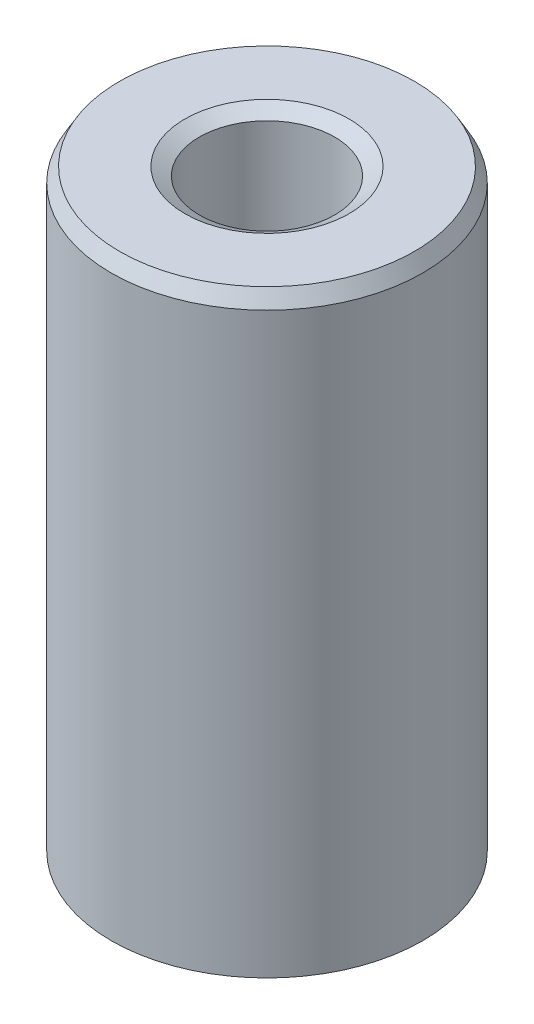
ISO-10303-21;
HEADER;
FILE_DESCRIPTION(('STEP AP214'),'2;1');
FILE_NAME('part.step','',(''),(''),'','','');
FILE_SCHEMA(('AUTOMOTIVE_DESIGN { 1 0 10303 214 1 1 1 1 }'));
ENDSEC;
DATA;
#1=APPLICATION_CONTEXT('core data for automotive mechanical design processes');
#2=APPLICATION_PROTOCOL_DEFINITION('international standard','automotive_design',2000,#1);
#3=PRODUCT_CONTEXT('',#1,'mechanical');
#4=PRODUCT('Part','Part','',(#3));
#5=PRODUCT_RELATED_PRODUCT_CATEGORY('part','',(#4));
#6=PRODUCT_DEFINITION_FORMATION('','',#4);
#7=PRODUCT_DEFINITION_CONTEXT('part definition',#1,'design');
#8=PRODUCT_DEFINITION('design','',#6,#7);
#9=PRODUCT_DEFINITION_SHAPE('','',#8);
#10=(LENGTH_UNIT() NAMED_UNIT(*) SI_UNIT(.MILLI.,.METRE.));
#11=(NAMED_UNIT(*) PLANE_ANGLE_UNIT() SI_UNIT($,.RADIAN.));
#12=(NAMED_UNIT(*) SI_UNIT($,.STERADIAN.) SOLID_ANGLE_UNIT());
#13=UNCERTAINTY_MEASURE_WITH_UNIT(LENGTH_MEASURE(1.E-05),#10,'distance_accuracy_value','');
#14=(GEOMETRIC_REPRESENTATION_CONTEXT(3) GLOBAL_UNCERTAINTY_ASSIGNED_CONTEXT((#13)) GLOBAL_UNIT_ASSIGNED_CONTEXT((#10,
#11,#12)) REPRESENTATION_CONTEXT('',''));
#15=CARTESIAN_POINT('',(0.,0.,0.));
#16=DIRECTION('',(0.,0.,1.));
#17=DIRECTION('',(1.,0.,0.));
#18=AXIS2_PLACEMENT_3D('',#15,#16,#17);
#19=CARTESIAN_POINT('',(0.,67.527914326703,0.));
#20=DIRECTION('',(0.,-1.,0.));
#21=DIRECTION('',(0.,0.,-1.));
#22=AXIS2_PLACEMENT_3D('',#19,#20,#21);
#23=CYLINDRICAL_SURFACE('',#22,17.5);
#24=CARTESIAN_POINT('',(0.,0.939467789457651,0.));
#25=DIRECTION('',(0.,1.,0.));
#26=DIRECTION('',(0.,0.,1.));
#27=AXIS2_PLACEMENT_3D('',#24,#25,#26);
#28=CIRCLE('',#27,17.5);
#29=CARTESIAN_POINT('',(0.,0.939467789457651,17.5));
#30=VERTEX_POINT('',#29);
#31=EDGE_CURVE('E10',#30,#30,#28,.T.);
#32=ORIENTED_EDGE('',*,*,#31,.T.);
#33=EDGE_LOOP('',(#32));
#34=FACE_BOUND('',#33,.T.);
#35=CARTESIAN_POINT('',(0.,65.9007083832879,0.));
#36=DIRECTION('',(0.,1.,0.));
#37=DIRECTION('',(0.,0.,1.));
#38=AXIS2_PLACEMENT_3D('',#35,#36,#37);
#39=CIRCLE('',#38,17.5);
#40=CARTESIAN_POINT('',(0.,65.9007083832879,17.5));
#41=VERTEX_POINT('',#40);
#42=EDGE_CURVE('E50',#41,#41,#39,.F.);
#43=ORIENTED_EDGE('',*,*,#42,.T.);
#44=EDGE_LOOP('',(#43));
#45=FACE_BOUND('',#44,.T.);
#46=ADVANCED_FACE('F39',(#34,#45),#23,.T.);
#47=CARTESIAN_POINT('',(0.,67.527914326703,0.));
#48=DIRECTION('',(0.,1.,0.));
#49=DIRECTION('',(0.,0.,1.));
#50=AXIS2_PLACEMENT_3D('',#47,#48,#49);
#51=PLANE('',#50);
#52=CARTESIAN_POINT('',(0.,67.527914326703,0.));
#53=DIRECTION('',(0.,1.,0.));
#54=DIRECTION('',(0.,0.,1.));
#55=AXIS2_PLACEMENT_3D('',#52,#53,#54);
#56=CIRCLE('',#55,9.22481493991566);
#57=CARTESIAN_POINT('',(0.,67.527914326703,9.22481493991566));
#58=VERTEX_POINT('',#57);
#59=EDGE_CURVE('E58',#58,#58,#56,.F.);
#60=ORIENTED_EDGE('',*,*,#59,.T.);
#61=EDGE_LOOP('',(#60));
#62=FACE_BOUND('',#61,.T.);
#63=CARTESIAN_POINT('',(0.,67.527914326703,0.));
#64=DIRECTION('',(0.,1.,0.));
#65=DIRECTION('',(0.,0.,1.));
#66=AXIS2_PLACEMENT_3D('',#63,#64,#65);
#67=CIRCLE('',#66,16.5605322105423);
#68=CARTESIAN_POINT('',(0.,67.527914326703,16.5605322105423));
#69=VERTEX_POINT('',#68);
#70=EDGE_CURVE('E61',#69,#69,#67,.T.);
#71=ORIENTED_EDGE('',*,*,#70,.T.);
#72=EDGE_LOOP('',(#71));
#73=FACE_BOUND('',#72,.T.);
#74=ADVANCED_FACE('F88',(#62,#73),#51,.T.);
#75=CARTESIAN_POINT('',(0.,0.,0.));
#76=DIRECTION('',(0.,1.,0.));
#77=DIRECTION('',(0.,0.,1.));
#78=AXIS2_PLACEMENT_3D('',#75,#76,#77);
#79=PLANE('',#78);
#80=CARTESIAN_POINT('',(0.,0.,0.));
#81=DIRECTION('',(0.,1.,0.));
#82=DIRECTION('',(0.,0.,1.));
#83=AXIS2_PLACEMENT_3D('',#80,#81,#82);
#84=CIRCLE('',#83,8.53707678595826);
#85=CARTESIAN_POINT('',(0.,0.,8.53707678595826));
#86=VERTEX_POINT('',#85);
#87=EDGE_CURVE('E51',#86,#86,#84,.T.);
#88=ORIENTED_EDGE('',*,*,#87,.T.);
#89=EDGE_LOOP('',(#88));
#90=FACE_BOUND('',#89,.T.);
#91=CARTESIAN_POINT('',(0.,0.,0.));
#92=DIRECTION('',(0.,1.,0.));
#93=DIRECTION('',(0.,0.,1.));
#94=AXIS2_PLACEMENT_3D('',#91,#92,#93);
#95=CIRCLE('',#94,15.8727940565849);
#96=CARTESIAN_POINT('',(0.,0.,15.8727940565849));
#97=VERTEX_POINT('',#96);
#98=EDGE_CURVE('E54',#97,#97,#95,.F.);
#99=ORIENTED_EDGE('',*,*,#98,.T.);
#100=EDGE_LOOP('',(#99));
#101=FACE_BOUND('',#100,.T.);
#102=ADVANCED_FACE('F83',(#90,#101),#79,.F.);
#103=CARTESIAN_POINT('',(0.,67.527914326703,0.));
#104=DIRECTION('',(0.,-1.,0.));
#105=DIRECTION('',(0.,0.,-1.));
#106=AXIS2_PLACEMENT_3D('',#103,#104,#105);
#107=CYLINDRICAL_SURFACE('',#106,7.59760899650061);
#108=CARTESIAN_POINT('',(0.,66.5884465372454,0.));
#109=DIRECTION('',(0.,1.,0.));
#110=DIRECTION('',(0.,0.,1.));
#111=AXIS2_PLACEMENT_3D('',#108,#109,#110);
#112=CIRCLE('',#111,7.59760899650061);
#113=CARTESIAN_POINT('',(0.,66.5884465372454,7.59760899650061));
#114=VERTEX_POINT('',#113);
#115=EDGE_CURVE('E67',#114,#114,#112,.T.);
#116=ORIENTED_EDGE('',*,*,#115,.T.);
#117=EDGE_LOOP('',(#116));
#118=FACE_BOUND('',#117,.T.);
#119=CARTESIAN_POINT('',(0.,1.62720594341507,0.));
#120=DIRECTION('',(0.,1.,0.));
#121=DIRECTION('',(0.,0.,1.));
#122=AXIS2_PLACEMENT_3D('',#119,#120,#121);
#123=CIRCLE('',#122,7.59760899650061);
#124=CARTESIAN_POINT('',(0.,1.62720594341507,7.59760899650061));
#125=VERTEX_POINT('',#124);
#126=EDGE_CURVE('E69',#125,#125,#123,.F.);
#127=ORIENTED_EDGE('',*,*,#126,.T.);
#128=EDGE_LOOP('',(#127));
#129=FACE_BOUND('',#128,.T.);
#130=ADVANCED_FACE('F71',(#118,#129),#107,.F.);
#131=CARTESIAN_POINT('',(0.,66.5884465372454,0.));
#132=DIRECTION('',(0.,1.,0.));
#133=DIRECTION('',(0.,0.,1.));
#134=AXIS2_PLACEMENT_3D('',#131,#132,#133);
#135=CONICAL_SURFACE('',#134,7.59760899650061,1.0471975511966);
#136=ORIENTED_EDGE('',*,*,#59,.F.);
#137=EDGE_LOOP('',(#136));
#138=FACE_BOUND('',#137,.T.);
#139=ORIENTED_EDGE('',*,*,#115,.F.);
#140=EDGE_LOOP('',(#139));
#141=FACE_BOUND('',#140,.T.);
#142=ADVANCED_FACE('F77',(#138,#141),#135,.F.);
#143=CARTESIAN_POINT('',(0.,0.,0.));
#144=DIRECTION('',(0.,-1.,0.));
#145=DIRECTION('',(0.,0.,-1.));
#146=AXIS2_PLACEMENT_3D('',#143,#144,#145);
#147=CONICAL_SURFACE('',#146,8.53707678595826,0.523598775598296);
#148=ORIENTED_EDGE('',*,*,#126,.F.);
#149=EDGE_LOOP('',(#148));
#150=FACE_BOUND('',#149,.T.);
#151=ORIENTED_EDGE('',*,*,#87,.F.);
#152=EDGE_LOOP('',(#151));
#153=FACE_BOUND('',#152,.T.);
#154=ADVANCED_FACE('F73',(#150,#153),#147,.F.);
#155=CARTESIAN_POINT('',(0.,0.939467789457651,0.));
#156=DIRECTION('',(0.,1.,0.));
#157=DIRECTION('',(0.,0.,1.));
#158=AXIS2_PLACEMENT_3D('',#155,#156,#157);
#159=CONICAL_SURFACE('',#158,17.5,1.0471975511966);
#160=ORIENTED_EDGE('',*,*,#98,.F.);
#161=EDGE_LOOP('',(#160));
#162=FACE_BOUND('',#161,.T.);
#163=ORIENTED_EDGE('',*,*,#31,.F.);
#164=EDGE_LOOP('',(#163));
#165=FACE_BOUND('',#164,.T.);
#166=ADVANCED_FACE('F76',(#162,#165),#159,.T.);
#167=CARTESIAN_POINT('',(0.,67.527914326703,0.));
#168=DIRECTION('',(0.,-1.,0.));
#169=DIRECTION('',(0.,0.,-1.));
#170=AXIS2_PLACEMENT_3D('',#167,#168,#169);
#171=CONICAL_SURFACE('',#170,16.5605322105423,0.523598775598292);
#172=ORIENTED_EDGE('',*,*,#42,.F.);
#173=EDGE_LOOP('',(#172));
#174=FACE_BOUND('',#173,.T.);
#175=ORIENTED_EDGE('',*,*,#70,.F.);
#176=EDGE_LOOP('',(#175));
#177=FACE_BOUND('',#176,.T.);
#178=ADVANCED_FACE('F45',(#174,#177),#171,.T.);
#179=CLOSED_SHELL('',(#46,#74,#102,#130,#142,#154,#166,#178));
#180=MANIFOLD_SOLID_BREP('B2',#179);
#181=ADVANCED_BREP_SHAPE_REPRESENTATION('',(#18,#180),#14);
#182=SHAPE_DEFINITION_REPRESENTATION(#9,#181);
ENDSEC;
END-ISO-10303-21;
